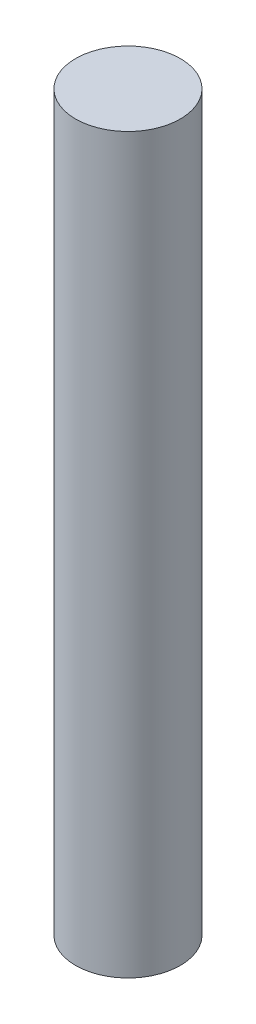
ISO-10303-21;
HEADER;
FILE_DESCRIPTION(('STEP AP214'),'2;1');
FILE_NAME('part.step','',(''),(''),'','','');
FILE_SCHEMA(('AUTOMOTIVE_DESIGN { 1 0 10303 214 1 1 1 1 }'));
ENDSEC;
DATA;
#1=APPLICATION_CONTEXT('core data for automotive mechanical design processes');
#2=APPLICATION_PROTOCOL_DEFINITION('international standard','automotive_design',2000,#1);
#3=PRODUCT_CONTEXT('',#1,'mechanical');
#4=PRODUCT('Part','Part','',(#3));
#5=PRODUCT_RELATED_PRODUCT_CATEGORY('part','',(#4));
#6=PRODUCT_DEFINITION_FORMATION('','',#4);
#7=PRODUCT_DEFINITION_CONTEXT('part definition',#1,'design');
#8=PRODUCT_DEFINITION('design','',#6,#7);
#9=PRODUCT_DEFINITION_SHAPE('','',#8);
#10=(LENGTH_UNIT() NAMED_UNIT(*) SI_UNIT(.MILLI.,.METRE.));
#11=(NAMED_UNIT(*) PLANE_ANGLE_UNIT() SI_UNIT($,.RADIAN.));
#12=(NAMED_UNIT(*) SI_UNIT($,.STERADIAN.) SOLID_ANGLE_UNIT());
#13=UNCERTAINTY_MEASURE_WITH_UNIT(LENGTH_MEASURE(1.E-05),#10,'distance_accuracy_value','');
#14=(GEOMETRIC_REPRESENTATION_CONTEXT(3) GLOBAL_UNCERTAINTY_ASSIGNED_CONTEXT((#13)) GLOBAL_UNIT_ASSIGNED_CONTEXT((#10,
#11,#12)) REPRESENTATION_CONTEXT('',''));
#15=CARTESIAN_POINT('',(0.,0.,0.));
#16=DIRECTION('',(0.,0.,1.));
#17=DIRECTION('',(1.,0.,0.));
#18=AXIS2_PLACEMENT_3D('',#15,#16,#17);
#19=CARTESIAN_POINT('',(-7.88594740109235,35.56,0.297913568485711));
#20=DIRECTION('',(0.,-1.,0.));
#21=DIRECTION('',(0.,0.,-1.));
#22=AXIS2_PLACEMENT_3D('',#19,#20,#21);
#23=CYLINDRICAL_SURFACE('',#22,2.54);
#24=CARTESIAN_POINT('',(-7.88594740109235,35.56,0.297913568485711));
#25=DIRECTION('',(0.,1.,0.));
#26=DIRECTION('',(0.,0.,1.));
#27=AXIS2_PLACEMENT_3D('',#24,#25,#26);
#28=CIRCLE('',#27,2.54);
#29=CARTESIAN_POINT('',(-7.88594740109235,35.56,2.83791356848571));
#30=VERTEX_POINT('',#29);
#31=EDGE_CURVE('E10',#30,#30,#28,.T.);
#32=ORIENTED_EDGE('',*,*,#31,.F.);
#33=EDGE_LOOP('',(#32));
#34=FACE_BOUND('',#33,.T.);
#35=CARTESIAN_POINT('',(-7.88594740109235,0.,0.297913568485711));
#36=DIRECTION('',(0.,1.,0.));
#37=DIRECTION('',(0.,0.,1.));
#38=AXIS2_PLACEMENT_3D('',#35,#36,#37);
#39=CIRCLE('',#38,2.54);
#40=CARTESIAN_POINT('',(-7.88594740109235,0.,2.83791356848571));
#41=VERTEX_POINT('',#40);
#42=EDGE_CURVE('E40',#41,#41,#39,.T.);
#43=ORIENTED_EDGE('',*,*,#42,.T.);
#44=EDGE_LOOP('',(#43));
#45=FACE_BOUND('',#44,.T.);
#46=ADVANCED_FACE('F37',(#34,#45),#23,.T.);
#47=CARTESIAN_POINT('',(-7.88594740109235,35.56,0.297913568485711));
#48=DIRECTION('',(0.,1.,0.));
#49=DIRECTION('',(0.,0.,1.));
#50=AXIS2_PLACEMENT_3D('',#47,#48,#49);
#51=PLANE('',#50);
#52=ORIENTED_EDGE('',*,*,#31,.T.);
#53=EDGE_LOOP('',(#52));
#54=FACE_BOUND('',#53,.T.);
#55=ADVANCED_FACE('F54',(#54),#51,.T.);
#56=CARTESIAN_POINT('',(-7.88594740109235,0.,0.297913568485711));
#57=DIRECTION('',(0.,1.,0.));
#58=DIRECTION('',(0.,0.,1.));
#59=AXIS2_PLACEMENT_3D('',#56,#57,#58);
#60=PLANE('',#59);
#61=ORIENTED_EDGE('',*,*,#42,.F.);
#62=EDGE_LOOP('',(#61));
#63=FACE_BOUND('',#62,.T.);
#64=ADVANCED_FACE('F52',(#63),#60,.F.);
#65=CLOSED_SHELL('',(#46,#55,#64));
#66=MANIFOLD_SOLID_BREP('B2',#65);
#67=ADVANCED_BREP_SHAPE_REPRESENTATION('',(#18,#66),#14);
#68=SHAPE_DEFINITION_REPRESENTATION(#9,#67);
ENDSEC;
END-ISO-10303-21;
